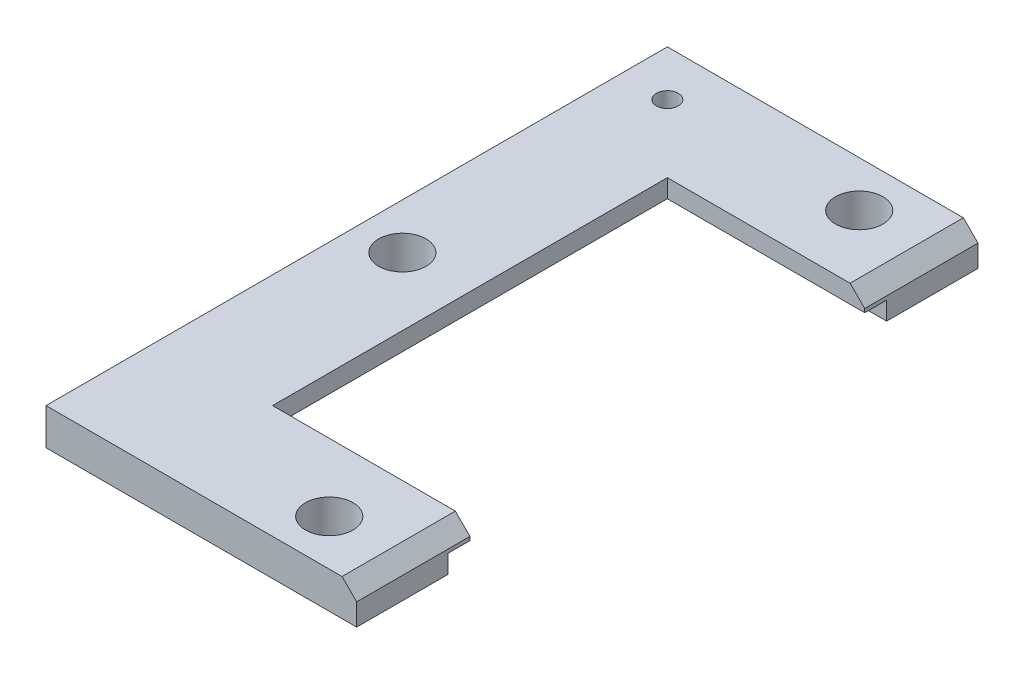
ISO-10303-21;
HEADER;
FILE_DESCRIPTION(('STEP AP214'),'2;1');
FILE_NAME('part.step','',(''),(''),'','','');
FILE_SCHEMA(('AUTOMOTIVE_DESIGN { 1 0 10303 214 1 1 1 1 }'));
ENDSEC;
DATA;
#1=APPLICATION_CONTEXT('core data for automotive mechanical design processes');
#2=APPLICATION_PROTOCOL_DEFINITION('international standard','automotive_design',2000,#1);
#3=PRODUCT_CONTEXT('',#1,'mechanical');
#4=PRODUCT('Part','Part','',(#3));
#5=PRODUCT_RELATED_PRODUCT_CATEGORY('part','',(#4));
#6=PRODUCT_DEFINITION_FORMATION('','',#4);
#7=PRODUCT_DEFINITION_CONTEXT('part definition',#1,'design');
#8=PRODUCT_DEFINITION('design','',#6,#7);
#9=PRODUCT_DEFINITION_SHAPE('','',#8);
#10=(LENGTH_UNIT() NAMED_UNIT(*) SI_UNIT(.MILLI.,.METRE.));
#11=(NAMED_UNIT(*) PLANE_ANGLE_UNIT() SI_UNIT($,.RADIAN.));
#12=(NAMED_UNIT(*) SI_UNIT($,.STERADIAN.) SOLID_ANGLE_UNIT());
#13=UNCERTAINTY_MEASURE_WITH_UNIT(LENGTH_MEASURE(1.E-05),#10,'distance_accuracy_value','');
#14=(GEOMETRIC_REPRESENTATION_CONTEXT(3) GLOBAL_UNCERTAINTY_ASSIGNED_CONTEXT((#13)) GLOBAL_UNIT_ASSIGNED_CONTEXT((#10,
#11,#12)) REPRESENTATION_CONTEXT('',''));
#15=CARTESIAN_POINT('',(0.,0.,0.));
#16=DIRECTION('',(0.,0.,1.));
#17=DIRECTION('',(1.,0.,0.));
#18=AXIS2_PLACEMENT_3D('',#15,#16,#17);
#19=CARTESIAN_POINT('',(-187.176602680489,10.,54.));
#20=DIRECTION('',(0.,0.,1.));
#21=DIRECTION('',(1.,0.,0.));
#22=AXIS2_PLACEMENT_3D('',#19,#20,#21);
#23=PLANE('',#22);
#24=DIRECTION('',(-1.,0.,0.));
#25=VECTOR('',#24,1.);
#26=CARTESIAN_POINT('',(-187.176602680489,10.,54.));
#27=LINE('',#26,#25);
#28=CARTESIAN_POINT('',(-137.176602680489,10.,54.));
#29=VERTEX_POINT('',#28);
#30=CARTESIAN_POINT('',(-187.176602680489,10.,54.));
#31=VERTEX_POINT('',#30);
#32=EDGE_CURVE('E174',#29,#31,#27,.T.);
#33=ORIENTED_EDGE('',*,*,#32,.F.);
#34=DIRECTION('',(0.707106781186543,-0.707106781186552,0.));
#35=VECTOR('',#34,1.);
#36=CARTESIAN_POINT('',(-137.176602680489,10.,54.));
#37=LINE('',#36,#35);
#38=CARTESIAN_POINT('',(-133.176602680489,5.99999999999997,54.));
#39=VERTEX_POINT('',#38);
#40=EDGE_CURVE('E221',#29,#39,#37,.T.);
#41=ORIENTED_EDGE('',*,*,#40,.T.);
#42=DIRECTION('',(0.,-1.,0.));
#43=VECTOR('',#42,1.);
#44=CARTESIAN_POINT('',(-133.176602680489,10.,54.));
#45=LINE('',#44,#43);
#46=CARTESIAN_POINT('',(-133.176602680489,5.,54.));
#47=VERTEX_POINT('',#46);
#48=EDGE_CURVE('E208',#39,#47,#45,.T.);
#49=ORIENTED_EDGE('',*,*,#48,.T.);
#50=DIRECTION('',(1.,0.,0.));
#51=VECTOR('',#50,1.);
#52=CARTESIAN_POINT('',(-187.176602680489,5.,54.));
#53=LINE('',#52,#51);
#54=CARTESIAN_POINT('',(-187.176602680489,5.,54.));
#55=VERTEX_POINT('',#54);
#56=EDGE_CURVE('E151',#55,#47,#53,.T.);
#57=ORIENTED_EDGE('',*,*,#56,.F.);
#58=DIRECTION('',(0.,-1.,0.));
#59=VECTOR('',#58,1.);
#60=CARTESIAN_POINT('',(-187.176602680489,10.,54.));
#61=LINE('',#60,#59);
#62=EDGE_CURVE('E205',#31,#55,#61,.T.);
#63=ORIENTED_EDGE('',*,*,#62,.F.);
#64=EDGE_LOOP('',(#33,#41,#49,#57,#63));
#65=FACE_BOUND('',#64,.T.);
#66=ADVANCED_FACE('F34',(#65),#23,.F.);
#67=CARTESIAN_POINT('',(-187.176602680489,10.,-54.));
#68=DIRECTION('',(-1.,0.,0.));
#69=DIRECTION('',(0.,0.,1.));
#70=AXIS2_PLACEMENT_3D('',#67,#68,#69);
#71=PLANE('',#70);
#72=DIRECTION('',(0.,0.,1.));
#73=VECTOR('',#72,1.);
#74=CARTESIAN_POINT('',(-187.176602680489,5.,-54.));
#75=LINE('',#74,#73);
#76=CARTESIAN_POINT('',(-187.176602680489,5.,-54.));
#77=VERTEX_POINT('',#76);
#78=EDGE_CURVE('E163',#77,#55,#75,.T.);
#79=ORIENTED_EDGE('',*,*,#78,.F.);
#80=DIRECTION('',(0.,-1.,0.));
#81=VECTOR('',#80,1.);
#82=CARTESIAN_POINT('',(-187.176602680489,10.,-54.));
#83=LINE('',#82,#81);
#84=CARTESIAN_POINT('',(-187.176602680489,10.,-54.));
#85=VERTEX_POINT('',#84);
#86=EDGE_CURVE('E202',#85,#77,#83,.T.);
#87=ORIENTED_EDGE('',*,*,#86,.F.);
#88=DIRECTION('',(0.,0.,-1.));
#89=VECTOR('',#88,1.);
#90=CARTESIAN_POINT('',(-187.176602680489,10.,-54.));
#91=LINE('',#90,#89);
#92=EDGE_CURVE('E176',#31,#85,#91,.T.);
#93=ORIENTED_EDGE('',*,*,#92,.F.);
#94=ORIENTED_EDGE('',*,*,#62,.T.);
#95=EDGE_LOOP('',(#79,#87,#93,#94));
#96=FACE_BOUND('',#95,.T.);
#97=ADVANCED_FACE('F283',(#96),#71,.F.);
#98=CARTESIAN_POINT('',(-187.176602680489,10.,-54.));
#99=DIRECTION('',(0.,0.,-1.));
#100=DIRECTION('',(-1.,0.,0.));
#101=AXIS2_PLACEMENT_3D('',#98,#99,#100);
#102=PLANE('',#101);
#103=DIRECTION('',(0.,-1.,0.));
#104=VECTOR('',#103,1.);
#105=CARTESIAN_POINT('',(-133.176602680489,10.,-54.));
#106=LINE('',#105,#104);
#107=CARTESIAN_POINT('',(-133.176602680489,5.99999999999997,-54.));
#108=VERTEX_POINT('',#107);
#109=CARTESIAN_POINT('',(-133.176602680489,5.,-54.));
#110=VERTEX_POINT('',#109);
#111=EDGE_CURVE('E200',#108,#110,#106,.T.);
#112=ORIENTED_EDGE('',*,*,#111,.F.);
#113=DIRECTION('',(-0.707106781186543,0.707106781186552,0.));
#114=VECTOR('',#113,1.);
#115=CARTESIAN_POINT('',(-137.176602680489,10.,-54.));
#116=LINE('',#115,#114);
#117=CARTESIAN_POINT('',(-137.176602680489,10.,-54.));
#118=VERTEX_POINT('',#117);
#119=EDGE_CURVE('E11',#108,#118,#116,.T.);
#120=ORIENTED_EDGE('',*,*,#119,.T.);
#121=DIRECTION('',(1.,0.,0.));
#122=VECTOR('',#121,1.);
#123=CARTESIAN_POINT('',(-187.176602680489,10.,-54.));
#124=LINE('',#123,#122);
#125=EDGE_CURVE('E178',#85,#118,#124,.T.);
#126=ORIENTED_EDGE('',*,*,#125,.F.);
#127=ORIENTED_EDGE('',*,*,#86,.T.);
#128=DIRECTION('',(-1.,0.,0.));
#129=VECTOR('',#128,1.);
#130=CARTESIAN_POINT('',(-133.176602680489,5.,-54.));
#131=LINE('',#130,#129);
#132=EDGE_CURVE('E275',#110,#77,#131,.T.);
#133=ORIENTED_EDGE('',*,*,#132,.F.);
#134=EDGE_LOOP('',(#112,#120,#126,#127,#133));
#135=FACE_BOUND('',#134,.T.);
#136=ADVANCED_FACE('F289',(#135),#102,.F.);
#137=CARTESIAN_POINT('',(-218.176602680489,10.,-85.));
#138=DIRECTION('',(1.,0.,0.));
#139=DIRECTION('',(0.,0.,-1.));
#140=AXIS2_PLACEMENT_3D('',#137,#138,#139);
#141=PLANE('',#140);
#142=DIRECTION('',(0.,0.,1.));
#143=VECTOR('',#142,1.);
#144=CARTESIAN_POINT('',(-218.176602680489,0.,-85.));
#145=LINE('',#144,#143);
#146=CARTESIAN_POINT('',(-218.176602680489,0.,-85.));
#147=VERTEX_POINT('',#146);
#148=CARTESIAN_POINT('',(-218.176602680489,0.,85.));
#149=VERTEX_POINT('',#148);
#150=EDGE_CURVE('E184',#147,#149,#145,.T.);
#151=ORIENTED_EDGE('',*,*,#150,.T.);
#152=DIRECTION('',(0.,-1.,0.));
#153=VECTOR('',#152,1.);
#154=CARTESIAN_POINT('',(-218.176602680489,10.,85.));
#155=LINE('',#154,#153);
#156=CARTESIAN_POINT('',(-218.176602680489,10.,85.));
#157=VERTEX_POINT('',#156);
#158=EDGE_CURVE('E212',#157,#149,#155,.T.);
#159=ORIENTED_EDGE('',*,*,#158,.F.);
#160=DIRECTION('',(0.,0.,1.));
#161=VECTOR('',#160,1.);
#162=CARTESIAN_POINT('',(-218.176602680489,10.,-85.));
#163=LINE('',#162,#161);
#164=CARTESIAN_POINT('',(-218.176602680489,10.,-85.));
#165=VERTEX_POINT('',#164);
#166=EDGE_CURVE('E167',#165,#157,#163,.T.);
#167=ORIENTED_EDGE('',*,*,#166,.F.);
#168=DIRECTION('',(0.,-1.,0.));
#169=VECTOR('',#168,1.);
#170=CARTESIAN_POINT('',(-218.176602680489,10.,-85.));
#171=LINE('',#170,#169);
#172=EDGE_CURVE('E183',#165,#147,#171,.T.);
#173=ORIENTED_EDGE('',*,*,#172,.T.);
#174=EDGE_LOOP('',(#151,#159,#167,#173));
#175=FACE_BOUND('',#174,.T.);
#176=ADVANCED_FACE('F291',(#175),#141,.F.);
#177=CARTESIAN_POINT('',(-218.176602680489,10.,85.));
#178=DIRECTION('',(0.,0.,-1.));
#179=DIRECTION('',(-1.,0.,0.));
#180=AXIS2_PLACEMENT_3D('',#177,#178,#179);
#181=PLANE('',#180);
#182=DIRECTION('',(0.,-1.,0.));
#183=VECTOR('',#182,1.);
#184=CARTESIAN_POINT('',(-133.176602680489,10.,85.));
#185=LINE('',#184,#183);
#186=CARTESIAN_POINT('',(-133.176602680489,5.99999999999997,85.));
#187=VERTEX_POINT('',#186);
#188=CARTESIAN_POINT('',(-133.176602680489,0.,85.));
#189=VERTEX_POINT('',#188);
#190=EDGE_CURVE('E210',#187,#189,#185,.T.);
#191=ORIENTED_EDGE('',*,*,#190,.F.);
#192=DIRECTION('',(-0.707106781186543,0.707106781186552,0.));
#193=VECTOR('',#192,1.);
#194=CARTESIAN_POINT('',(-137.176602680489,10.,85.));
#195=LINE('',#194,#193);
#196=CARTESIAN_POINT('',(-137.176602680489,10.,85.));
#197=VERTEX_POINT('',#196);
#198=EDGE_CURVE('E225',#187,#197,#195,.T.);
#199=ORIENTED_EDGE('',*,*,#198,.T.);
#200=DIRECTION('',(1.,0.,0.));
#201=VECTOR('',#200,1.);
#202=CARTESIAN_POINT('',(-218.176602680489,10.,85.));
#203=LINE('',#202,#201);
#204=EDGE_CURVE('E170',#157,#197,#203,.T.);
#205=ORIENTED_EDGE('',*,*,#204,.F.);
#206=ORIENTED_EDGE('',*,*,#158,.T.);
#207=DIRECTION('',(1.,0.,0.));
#208=VECTOR('',#207,1.);
#209=CARTESIAN_POINT('',(-218.176602680489,0.,85.));
#210=LINE('',#209,#208);
#211=EDGE_CURVE('E187',#149,#189,#210,.T.);
#212=ORIENTED_EDGE('',*,*,#211,.T.);
#213=EDGE_LOOP('',(#191,#199,#205,#206,#212));
#214=FACE_BOUND('',#213,.T.);
#215=ADVANCED_FACE('F230',(#214),#181,.F.);
#216=CARTESIAN_POINT('',(-133.176602680489,10.,85.));
#217=DIRECTION('',(-1.,0.,0.));
#218=DIRECTION('',(0.,0.,1.));
#219=AXIS2_PLACEMENT_3D('',#216,#217,#218);
#220=PLANE('',#219);
#221=ORIENTED_EDGE('',*,*,#48,.F.);
#222=DIRECTION('',(0.,0.,1.));
#223=VECTOR('',#222,1.);
#224=CARTESIAN_POINT('',(-133.176602680489,5.99999999999997,85.));
#225=LINE('',#224,#223);
#226=EDGE_CURVE('E223',#39,#187,#225,.T.);
#227=ORIENTED_EDGE('',*,*,#226,.T.);
#228=ORIENTED_EDGE('',*,*,#190,.T.);
#229=DIRECTION('',(0.,0.,-1.));
#230=VECTOR('',#229,1.);
#231=CARTESIAN_POINT('',(-133.176602680489,0.,85.));
#232=LINE('',#231,#230);
#233=CARTESIAN_POINT('',(-133.176602680489,0.,60.));
#234=VERTEX_POINT('',#233);
#235=EDGE_CURVE('E159',#189,#234,#232,.T.);
#236=ORIENTED_EDGE('',*,*,#235,.T.);
#237=DIRECTION('',(0.,-1.,0.));
#238=VECTOR('',#237,1.);
#239=CARTESIAN_POINT('',(-133.176602680489,5.,60.));
#240=LINE('',#239,#238);
#241=CARTESIAN_POINT('',(-133.176602680489,5.,60.));
#242=VERTEX_POINT('',#241);
#243=EDGE_CURVE('E138',#242,#234,#240,.T.);
#244=ORIENTED_EDGE('',*,*,#243,.F.);
#245=DIRECTION('',(0.,0.,1.));
#246=VECTOR('',#245,1.);
#247=CARTESIAN_POINT('',(-133.176602680489,5.,54.));
#248=LINE('',#247,#246);
#249=EDGE_CURVE('E145',#47,#242,#248,.T.);
#250=ORIENTED_EDGE('',*,*,#249,.F.);
#251=EDGE_LOOP('',(#221,#227,#228,#236,#244,#250));
#252=FACE_BOUND('',#251,.T.);
#253=ADVANCED_FACE('F157',(#252),#220,.F.);
#254=CARTESIAN_POINT('',(-133.176602680489,10.,-54.));
#255=DIRECTION('',(-1.,0.,0.));
#256=DIRECTION('',(0.,0.,1.));
#257=AXIS2_PLACEMENT_3D('',#254,#255,#256);
#258=PLANE('',#257);
#259=DIRECTION('',(0.,-1.,0.));
#260=VECTOR('',#259,1.);
#261=CARTESIAN_POINT('',(-133.176602680489,10.,-85.));
#262=LINE('',#261,#260);
#263=CARTESIAN_POINT('',(-133.176602680489,5.99999999999997,-85.));
#264=VERTEX_POINT('',#263);
#265=CARTESIAN_POINT('',(-133.176602680489,0.,-85.));
#266=VERTEX_POINT('',#265);
#267=EDGE_CURVE('E198',#264,#266,#262,.T.);
#268=ORIENTED_EDGE('',*,*,#267,.F.);
#269=DIRECTION('',(0.,0.,1.));
#270=VECTOR('',#269,1.);
#271=CARTESIAN_POINT('',(-133.176602680489,5.99999999999997,-54.));
#272=LINE('',#271,#270);
#273=EDGE_CURVE('E43',#264,#108,#272,.T.);
#274=ORIENTED_EDGE('',*,*,#273,.T.);
#275=ORIENTED_EDGE('',*,*,#111,.T.);
#276=DIRECTION('',(0.,0.,1.));
#277=VECTOR('',#276,1.);
#278=CARTESIAN_POINT('',(-133.176602680489,5.,-60.));
#279=LINE('',#278,#277);
#280=CARTESIAN_POINT('',(-133.176602680489,5.,-60.));
#281=VERTEX_POINT('',#280);
#282=EDGE_CURVE('E272',#281,#110,#279,.T.);
#283=ORIENTED_EDGE('',*,*,#282,.F.);
#284=DIRECTION('',(0.,-1.,0.));
#285=VECTOR('',#284,1.);
#286=CARTESIAN_POINT('',(-133.176602680489,5.,-60.));
#287=LINE('',#286,#285);
#288=CARTESIAN_POINT('',(-133.176602680489,0.,-60.));
#289=VERTEX_POINT('',#288);
#290=EDGE_CURVE('E188',#281,#289,#287,.T.);
#291=ORIENTED_EDGE('',*,*,#290,.T.);
#292=DIRECTION('',(0.,0.,-1.));
#293=VECTOR('',#292,1.);
#294=CARTESIAN_POINT('',(-133.176602680489,0.,-54.));
#295=LINE('',#294,#293);
#296=EDGE_CURVE('E192',#289,#266,#295,.T.);
#297=ORIENTED_EDGE('',*,*,#296,.T.);
#298=EDGE_LOOP('',(#268,#274,#275,#283,#291,#297));
#299=FACE_BOUND('',#298,.T.);
#300=ADVANCED_FACE('F269',(#299),#258,.F.);
#301=CARTESIAN_POINT('',(-218.176602680489,10.,-85.));
#302=DIRECTION('',(0.,0.,1.));
#303=DIRECTION('',(1.,0.,0.));
#304=AXIS2_PLACEMENT_3D('',#301,#302,#303);
#305=PLANE('',#304);
#306=DIRECTION('',(-1.,0.,0.));
#307=VECTOR('',#306,1.);
#308=CARTESIAN_POINT('',(-218.176602680489,10.,-85.));
#309=LINE('',#308,#307);
#310=CARTESIAN_POINT('',(-137.176602680489,10.,-85.));
#311=VERTEX_POINT('',#310);
#312=EDGE_CURVE('E181',#311,#165,#309,.T.);
#313=ORIENTED_EDGE('',*,*,#312,.F.);
#314=DIRECTION('',(0.707106781186543,-0.707106781186552,0.));
#315=VECTOR('',#314,1.);
#316=CARTESIAN_POINT('',(-137.176602680489,10.,-85.));
#317=LINE('',#316,#315);
#318=EDGE_CURVE('E57',#311,#264,#317,.T.);
#319=ORIENTED_EDGE('',*,*,#318,.T.);
#320=ORIENTED_EDGE('',*,*,#267,.T.);
#321=DIRECTION('',(-1.,0.,0.));
#322=VECTOR('',#321,1.);
#323=CARTESIAN_POINT('',(-218.176602680489,0.,-85.));
#324=LINE('',#323,#322);
#325=EDGE_CURVE('E171',#266,#147,#324,.T.);
#326=ORIENTED_EDGE('',*,*,#325,.T.);
#327=ORIENTED_EDGE('',*,*,#172,.F.);
#328=EDGE_LOOP('',(#313,#319,#320,#326,#327));
#329=FACE_BOUND('',#328,.T.);
#330=ADVANCED_FACE('F332',(#329),#305,.F.);
#331=CARTESIAN_POINT('',(0.,10.,0.));
#332=DIRECTION('',(0.,1.,0.));
#333=DIRECTION('',(0.,0.,1.));
#334=AXIS2_PLACEMENT_3D('',#331,#332,#333);
#335=PLANE('',#334);
#336=CARTESIAN_POINT('',(-205.676602680489,10.0000000000001,-72.5));
#337=DIRECTION('',(0.,-1.,0.));
#338=DIRECTION('',(0.,0.,-1.));
#339=AXIS2_PLACEMENT_3D('',#336,#337,#338);
#340=CIRCLE('',#339,2.99999999999999);
#341=CARTESIAN_POINT('',(-205.676602680489,10.0000000000001,-75.5));
#342=VERTEX_POINT('',#341);
#343=EDGE_CURVE('E463',#342,#342,#340,.T.);
#344=ORIENTED_EDGE('',*,*,#343,.T.);
#345=EDGE_LOOP('',(#344));
#346=FACE_BOUND('',#345,.T.);
#347=CARTESIAN_POINT('',(-153.176602680489,10.0000000000001,-72.5));
#348=DIRECTION('',(0.,-1.,0.));
#349=DIRECTION('',(0.,0.,-1.));
#350=AXIS2_PLACEMENT_3D('',#347,#348,#349);
#351=CIRCLE('',#350,6.50000000000002);
#352=CARTESIAN_POINT('',(-153.176602680489,10.0000000000001,-79.));
#353=VERTEX_POINT('',#352);
#354=EDGE_CURVE('E251',#353,#353,#351,.T.);
#355=ORIENTED_EDGE('',*,*,#354,.T.);
#356=EDGE_LOOP('',(#355));
#357=FACE_BOUND('',#356,.T.);
#358=CARTESIAN_POINT('',(-153.176602680489,10.,72.5));
#359=DIRECTION('',(0.,-1.,0.));
#360=DIRECTION('',(0.,0.,1.));
#361=AXIS2_PLACEMENT_3D('',#358,#359,#360);
#362=CIRCLE('',#361,6.50000000000002);
#363=CARTESIAN_POINT('',(-153.176602680489,10.,79.));
#364=VERTEX_POINT('',#363);
#365=EDGE_CURVE('E473',#364,#364,#362,.T.);
#366=ORIENTED_EDGE('',*,*,#365,.T.);
#367=EDGE_LOOP('',(#366));
#368=FACE_BOUND('',#367,.T.);
#369=CARTESIAN_POINT('',(-205.676562711096,10.0000000000001,0.));
#370=DIRECTION('',(0.,-1.,0.));
#371=DIRECTION('',(0.,0.,-1.));
#372=AXIS2_PLACEMENT_3D('',#369,#370,#371);
#373=CIRCLE('',#372,6.50000000000002);
#374=CARTESIAN_POINT('',(-205.676562711096,10.0000000000001,-6.49999999999999));
#375=VERTEX_POINT('',#374);
#376=EDGE_CURVE('E479',#375,#375,#373,.T.);
#377=ORIENTED_EDGE('',*,*,#376,.T.);
#378=EDGE_LOOP('',(#377));
#379=FACE_BOUND('',#378,.T.);
#380=ORIENTED_EDGE('',*,*,#204,.T.);
#381=DIRECTION('',(0.,0.,-1.));
#382=VECTOR('',#381,1.);
#383=CARTESIAN_POINT('',(-137.176602680489,10.,54.));
#384=LINE('',#383,#382);
#385=EDGE_CURVE('E218',#197,#29,#384,.T.);
#386=ORIENTED_EDGE('',*,*,#385,.T.);
#387=ORIENTED_EDGE('',*,*,#32,.T.);
#388=ORIENTED_EDGE('',*,*,#92,.T.);
#389=ORIENTED_EDGE('',*,*,#125,.T.);
#390=DIRECTION('',(0.,0.,-1.));
#391=VECTOR('',#390,1.);
#392=CARTESIAN_POINT('',(-137.176602680489,10.,-85.));
#393=LINE('',#392,#391);
#394=EDGE_CURVE('E215',#118,#311,#393,.T.);
#395=ORIENTED_EDGE('',*,*,#394,.T.);
#396=ORIENTED_EDGE('',*,*,#312,.T.);
#397=ORIENTED_EDGE('',*,*,#166,.T.);
#398=EDGE_LOOP('',(#380,#386,#387,#388,#389,#395,#396,#397));
#399=FACE_BOUND('',#398,.T.);
#400=ADVANCED_FACE('F235',(#346,#357,#368,#379,#399),#335,.T.);
#401=CARTESIAN_POINT('',(0.,0.,0.));
#402=DIRECTION('',(0.,1.,0.));
#403=DIRECTION('',(0.,0.,1.));
#404=AXIS2_PLACEMENT_3D('',#401,#402,#403);
#405=PLANE('',#404);
#406=CARTESIAN_POINT('',(-205.676602680489,0.,-72.5));
#407=DIRECTION('',(0.,-1.,0.));
#408=DIRECTION('',(0.,0.,-1.));
#409=AXIS2_PLACEMENT_3D('',#406,#407,#408);
#410=CIRCLE('',#409,2.99999999999999);
#411=CARTESIAN_POINT('',(-205.676602680489,0.,-75.5));
#412=VERTEX_POINT('',#411);
#413=EDGE_CURVE('E466',#412,#412,#410,.T.);
#414=ORIENTED_EDGE('',*,*,#413,.F.);
#415=EDGE_LOOP('',(#414));
#416=FACE_BOUND('',#415,.T.);
#417=CARTESIAN_POINT('',(-153.176602680489,0.,-72.5));
#418=DIRECTION('',(0.,-1.,0.));
#419=DIRECTION('',(0.,0.,-1.));
#420=AXIS2_PLACEMENT_3D('',#417,#418,#419);
#421=CIRCLE('',#420,6.50000000000002);
#422=CARTESIAN_POINT('',(-153.176602680489,0.,-79.));
#423=VERTEX_POINT('',#422);
#424=EDGE_CURVE('E255',#423,#423,#421,.T.);
#425=ORIENTED_EDGE('',*,*,#424,.F.);
#426=EDGE_LOOP('',(#425));
#427=FACE_BOUND('',#426,.T.);
#428=CARTESIAN_POINT('',(-153.176602680489,0.,72.5));
#429=DIRECTION('',(0.,-1.,0.));
#430=DIRECTION('',(0.,0.,1.));
#431=AXIS2_PLACEMENT_3D('',#428,#429,#430);
#432=CIRCLE('',#431,6.50000000000002);
#433=CARTESIAN_POINT('',(-153.176602680489,0.,79.));
#434=VERTEX_POINT('',#433);
#435=EDGE_CURVE('E476',#434,#434,#432,.T.);
#436=ORIENTED_EDGE('',*,*,#435,.F.);
#437=EDGE_LOOP('',(#436));
#438=FACE_BOUND('',#437,.T.);
#439=CARTESIAN_POINT('',(-205.676562711096,0.,0.));
#440=DIRECTION('',(0.,-1.,0.));
#441=DIRECTION('',(0.,0.,-1.));
#442=AXIS2_PLACEMENT_3D('',#439,#440,#441);
#443=CIRCLE('',#442,6.50000000000002);
#444=CARTESIAN_POINT('',(-205.676562711096,0.,-6.5));
#445=VERTEX_POINT('',#444);
#446=EDGE_CURVE('E468',#445,#445,#443,.T.);
#447=ORIENTED_EDGE('',*,*,#446,.F.);
#448=EDGE_LOOP('',(#447));
#449=FACE_BOUND('',#448,.T.);
#450=ORIENTED_EDGE('',*,*,#296,.F.);
#451=DIRECTION('',(1.,0.,0.));
#452=VECTOR('',#451,1.);
#453=CARTESIAN_POINT('',(-193.176602680489,0.,-60.));
#454=LINE('',#453,#452);
#455=CARTESIAN_POINT('',(-193.176602680489,0.,-60.));
#456=VERTEX_POINT('',#455);
#457=EDGE_CURVE('E154',#456,#289,#454,.T.);
#458=ORIENTED_EDGE('',*,*,#457,.F.);
#459=DIRECTION('',(0.,0.,-1.));
#460=VECTOR('',#459,1.);
#461=CARTESIAN_POINT('',(-193.176602680489,0.,60.));
#462=LINE('',#461,#460);
#463=CARTESIAN_POINT('',(-193.176602680489,0.,60.));
#464=VERTEX_POINT('',#463);
#465=EDGE_CURVE('E250',#464,#456,#462,.T.);
#466=ORIENTED_EDGE('',*,*,#465,.F.);
#467=DIRECTION('',(-1.,0.,0.));
#468=VECTOR('',#467,1.);
#469=CARTESIAN_POINT('',(-133.176602680489,0.,60.));
#470=LINE('',#469,#468);
#471=EDGE_CURVE('E247',#234,#464,#470,.T.);
#472=ORIENTED_EDGE('',*,*,#471,.F.);
#473=ORIENTED_EDGE('',*,*,#235,.F.);
#474=ORIENTED_EDGE('',*,*,#211,.F.);
#475=ORIENTED_EDGE('',*,*,#150,.F.);
#476=ORIENTED_EDGE('',*,*,#325,.F.);
#477=EDGE_LOOP('',(#450,#458,#466,#472,#473,#474,#475,#476));
#478=FACE_BOUND('',#477,.T.);
#479=ADVANCED_FACE('F245',(#416,#427,#438,#449,#478),#405,.F.);
#480=CARTESIAN_POINT('',(-193.176602680489,5.,-60.));
#481=DIRECTION('',(0.,0.,-1.));
#482=DIRECTION('',(-1.,0.,0.));
#483=AXIS2_PLACEMENT_3D('',#480,#481,#482);
#484=PLANE('',#483);
#485=ORIENTED_EDGE('',*,*,#457,.T.);
#486=ORIENTED_EDGE('',*,*,#290,.F.);
#487=DIRECTION('',(1.,0.,0.));
#488=VECTOR('',#487,1.);
#489=CARTESIAN_POINT('',(-193.176602680489,5.,-60.));
#490=LINE('',#489,#488);
#491=CARTESIAN_POINT('',(-193.176602680489,5.,-60.));
#492=VERTEX_POINT('',#491);
#493=EDGE_CURVE('E265',#492,#281,#490,.T.);
#494=ORIENTED_EDGE('',*,*,#493,.F.);
#495=DIRECTION('',(0.,-1.,0.));
#496=VECTOR('',#495,1.);
#497=CARTESIAN_POINT('',(-193.176602680489,5.,-60.));
#498=LINE('',#497,#496);
#499=EDGE_CURVE('E161',#492,#456,#498,.T.);
#500=ORIENTED_EDGE('',*,*,#499,.T.);
#501=EDGE_LOOP('',(#485,#486,#494,#500));
#502=FACE_BOUND('',#501,.T.);
#503=ADVANCED_FACE('F263',(#502),#484,.F.);
#504=CARTESIAN_POINT('',(-193.176602680489,5.,60.));
#505=DIRECTION('',(-1.,0.,0.));
#506=DIRECTION('',(0.,0.,1.));
#507=AXIS2_PLACEMENT_3D('',#504,#505,#506);
#508=PLANE('',#507);
#509=ORIENTED_EDGE('',*,*,#465,.T.);
#510=ORIENTED_EDGE('',*,*,#499,.F.);
#511=DIRECTION('',(0.,0.,-1.));
#512=VECTOR('',#511,1.);
#513=CARTESIAN_POINT('',(-193.176602680489,5.,60.));
#514=LINE('',#513,#512);
#515=CARTESIAN_POINT('',(-193.176602680489,5.,60.));
#516=VERTEX_POINT('',#515);
#517=EDGE_CURVE('E144',#516,#492,#514,.T.);
#518=ORIENTED_EDGE('',*,*,#517,.F.);
#519=DIRECTION('',(0.,-1.,0.));
#520=VECTOR('',#519,1.);
#521=CARTESIAN_POINT('',(-193.176602680489,5.,60.));
#522=LINE('',#521,#520);
#523=EDGE_CURVE('E140',#516,#464,#522,.T.);
#524=ORIENTED_EDGE('',*,*,#523,.T.);
#525=EDGE_LOOP('',(#509,#510,#518,#524));
#526=FACE_BOUND('',#525,.T.);
#527=ADVANCED_FACE('F267',(#526),#508,.F.);
#528=CARTESIAN_POINT('',(-133.176602680489,5.,60.));
#529=DIRECTION('',(0.,0.,1.));
#530=DIRECTION('',(1.,0.,0.));
#531=AXIS2_PLACEMENT_3D('',#528,#529,#530);
#532=PLANE('',#531);
#533=ORIENTED_EDGE('',*,*,#471,.T.);
#534=ORIENTED_EDGE('',*,*,#523,.F.);
#535=DIRECTION('',(-1.,0.,0.));
#536=VECTOR('',#535,1.);
#537=CARTESIAN_POINT('',(-133.176602680489,5.,60.));
#538=LINE('',#537,#536);
#539=EDGE_CURVE('E133',#242,#516,#538,.T.);
#540=ORIENTED_EDGE('',*,*,#539,.F.);
#541=ORIENTED_EDGE('',*,*,#243,.T.);
#542=EDGE_LOOP('',(#533,#534,#540,#541));
#543=FACE_BOUND('',#542,.T.);
#544=ADVANCED_FACE('F136',(#543),#532,.F.);
#545=CARTESIAN_POINT('',(0.,5.,0.));
#546=DIRECTION('',(0.,-1.,0.));
#547=DIRECTION('',(0.,0.,-1.));
#548=AXIS2_PLACEMENT_3D('',#545,#546,#547);
#549=PLANE('',#548);
#550=ORIENTED_EDGE('',*,*,#249,.T.);
#551=ORIENTED_EDGE('',*,*,#539,.T.);
#552=ORIENTED_EDGE('',*,*,#517,.T.);
#553=ORIENTED_EDGE('',*,*,#493,.T.);
#554=ORIENTED_EDGE('',*,*,#282,.T.);
#555=ORIENTED_EDGE('',*,*,#132,.T.);
#556=ORIENTED_EDGE('',*,*,#78,.T.);
#557=ORIENTED_EDGE('',*,*,#56,.T.);
#558=EDGE_LOOP('',(#550,#551,#552,#553,#554,#555,#556,#557));
#559=FACE_BOUND('',#558,.T.);
#560=ADVANCED_FACE('F149',(#559),#549,.T.);
#561=CARTESIAN_POINT('',(-137.176602680489,10.,0.));
#562=DIRECTION('',(0.707106781186552,0.707106781186543,0.));
#563=DIRECTION('',(0.,0.,1.));
#564=AXIS2_PLACEMENT_3D('',#561,#562,#563);
#565=PLANE('',#564);
#566=ORIENTED_EDGE('',*,*,#198,.F.);
#567=ORIENTED_EDGE('',*,*,#226,.F.);
#568=ORIENTED_EDGE('',*,*,#40,.F.);
#569=ORIENTED_EDGE('',*,*,#385,.F.);
#570=EDGE_LOOP('',(#566,#567,#568,#569));
#571=FACE_BOUND('',#570,.T.);
#572=ADVANCED_FACE('F239',(#571),#565,.T.);
#573=CARTESIAN_POINT('',(-137.176602680489,10.,0.));
#574=DIRECTION('',(0.707106781186552,0.707106781186543,0.));
#575=DIRECTION('',(0.,0.,1.));
#576=AXIS2_PLACEMENT_3D('',#573,#574,#575);
#577=PLANE('',#576);
#578=ORIENTED_EDGE('',*,*,#119,.F.);
#579=ORIENTED_EDGE('',*,*,#273,.F.);
#580=ORIENTED_EDGE('',*,*,#318,.F.);
#581=ORIENTED_EDGE('',*,*,#394,.F.);
#582=EDGE_LOOP('',(#578,#579,#580,#581));
#583=FACE_BOUND('',#582,.T.);
#584=ADVANCED_FACE('F37',(#583),#577,.T.);
#585=CARTESIAN_POINT('',(-205.676562711096,10.0000000000001,0.));
#586=DIRECTION('',(0.,-1.,0.));
#587=DIRECTION('',(0.,0.,-1.));
#588=AXIS2_PLACEMENT_3D('',#585,#586,#587);
#589=CYLINDRICAL_SURFACE('',#588,6.50000000000002);
#590=ORIENTED_EDGE('',*,*,#376,.F.);
#591=EDGE_LOOP('',(#590));
#592=FACE_BOUND('',#591,.T.);
#593=ORIENTED_EDGE('',*,*,#446,.T.);
#594=EDGE_LOOP('',(#593));
#595=FACE_BOUND('',#594,.T.);
#596=ADVANCED_FACE('F317',(#592,#595),#589,.F.);
#597=CARTESIAN_POINT('',(-153.176602680489,10.,72.5));
#598=DIRECTION('',(0.,-1.,0.));
#599=DIRECTION('',(0.,0.,-1.));
#600=AXIS2_PLACEMENT_3D('',#597,#598,#599);
#601=CYLINDRICAL_SURFACE('',#600,6.50000000000002);
#602=ORIENTED_EDGE('',*,*,#365,.F.);
#603=EDGE_LOOP('',(#602));
#604=FACE_BOUND('',#603,.T.);
#605=ORIENTED_EDGE('',*,*,#435,.T.);
#606=EDGE_LOOP('',(#605));
#607=FACE_BOUND('',#606,.T.);
#608=ADVANCED_FACE('F430',(#604,#607),#601,.F.);
#609=CARTESIAN_POINT('',(-153.176602680489,10.0000000000001,-72.5));
#610=DIRECTION('',(0.,-1.,0.));
#611=DIRECTION('',(0.,0.,-1.));
#612=AXIS2_PLACEMENT_3D('',#609,#610,#611);
#613=CYLINDRICAL_SURFACE('',#612,6.50000000000002);
#614=ORIENTED_EDGE('',*,*,#354,.F.);
#615=EDGE_LOOP('',(#614));
#616=FACE_BOUND('',#615,.T.);
#617=ORIENTED_EDGE('',*,*,#424,.T.);
#618=EDGE_LOOP('',(#617));
#619=FACE_BOUND('',#618,.T.);
#620=ADVANCED_FACE('F436',(#616,#619),#613,.F.);
#621=CARTESIAN_POINT('',(-205.676602680489,10.0000000000001,-72.5));
#622=DIRECTION('',(0.,-1.,0.));
#623=DIRECTION('',(0.,0.,-1.));
#624=AXIS2_PLACEMENT_3D('',#621,#622,#623);
#625=CYLINDRICAL_SURFACE('',#624,2.99999999999999);
#626=ORIENTED_EDGE('',*,*,#343,.F.);
#627=EDGE_LOOP('',(#626));
#628=FACE_BOUND('',#627,.T.);
#629=ORIENTED_EDGE('',*,*,#413,.T.);
#630=EDGE_LOOP('',(#629));
#631=FACE_BOUND('',#630,.T.);
#632=ADVANCED_FACE('F442',(#628,#631),#625,.F.);
#633=CLOSED_SHELL('',(#66,#97,#136,#176,#215,#253,#300,#330,#400,#479,#503,#527,#544,#560,#572,
#584,#596,#608,#620,#632));
#634=MANIFOLD_SOLID_BREP('B2',#633);
#635=ADVANCED_BREP_SHAPE_REPRESENTATION('',(#18,#634),#14);
#636=SHAPE_DEFINITION_REPRESENTATION(#9,#635);
ENDSEC;
END-ISO-10303-21;
